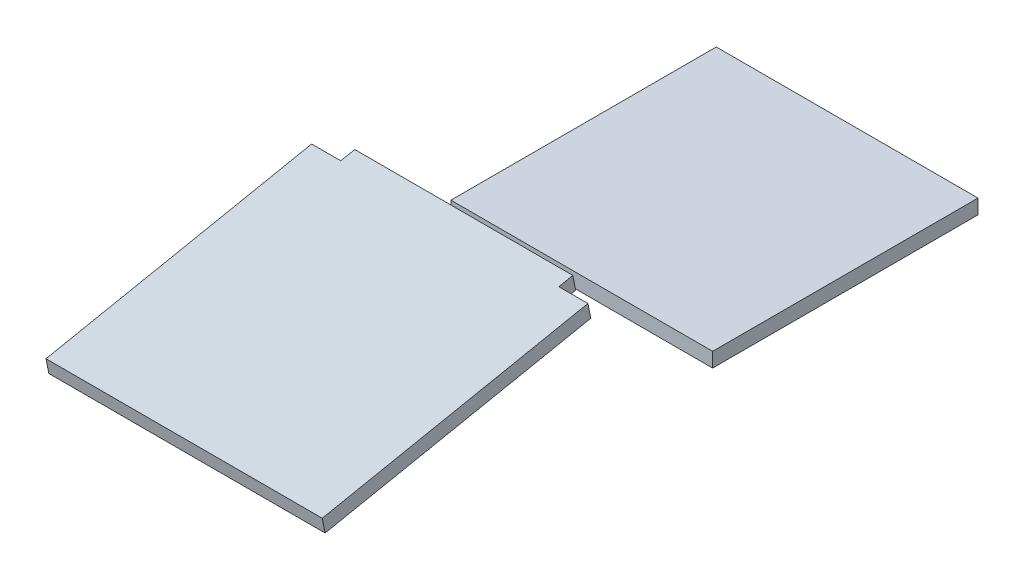
ISO-10303-21;
HEADER;
FILE_DESCRIPTION(('STEP AP214'),'2;1');
FILE_NAME('part.step','',(''),(''),'','','');
FILE_SCHEMA(('AUTOMOTIVE_DESIGN { 1 0 10303 214 1 1 1 1 }'));
ENDSEC;
DATA;
#1=APPLICATION_CONTEXT('core data for automotive mechanical design processes');
#2=APPLICATION_PROTOCOL_DEFINITION('international standard','automotive_design',2000,#1);
#3=PRODUCT_CONTEXT('',#1,'mechanical');
#4=PRODUCT('Part','Part','',(#3));
#5=PRODUCT_RELATED_PRODUCT_CATEGORY('part','',(#4));
#6=PRODUCT_DEFINITION_FORMATION('','',#4);
#7=PRODUCT_DEFINITION_CONTEXT('part definition',#1,'design');
#8=PRODUCT_DEFINITION('design','',#6,#7);
#9=PRODUCT_DEFINITION_SHAPE('','',#8);
#10=(LENGTH_UNIT() NAMED_UNIT(*) SI_UNIT(.MILLI.,.METRE.));
#11=(NAMED_UNIT(*) PLANE_ANGLE_UNIT() SI_UNIT($,.RADIAN.));
#12=(NAMED_UNIT(*) SI_UNIT($,.STERADIAN.) SOLID_ANGLE_UNIT());
#13=UNCERTAINTY_MEASURE_WITH_UNIT(LENGTH_MEASURE(1.E-05),#10,'distance_accuracy_value','');
#14=(GEOMETRIC_REPRESENTATION_CONTEXT(3) GLOBAL_UNCERTAINTY_ASSIGNED_CONTEXT((#13)) GLOBAL_UNIT_ASSIGNED_CONTEXT((#10,
#11,#12)) REPRESENTATION_CONTEXT('',''));
#15=CARTESIAN_POINT('',(0.,0.,0.));
#16=DIRECTION('',(0.,0.,1.));
#17=DIRECTION('',(1.,0.,0.));
#18=AXIS2_PLACEMENT_3D('',#15,#16,#17);
#19=CARTESIAN_POINT('',(-241.3,238.862481606681,457.347496321336));
#20=DIRECTION('',(1.,0.,0.));
#21=DIRECTION('',(0.,0.,-1.));
#22=AXIS2_PLACEMENT_3D('',#19,#20,#21);
#23=PLANE('',#22);
#24=DIRECTION('',(0.,0.196116135138184,-0.98058067569092));
#25=VECTOR('',#24,1.);
#26=CARTESIAN_POINT('',(-241.3,263.769230769231,462.328846153846));
#27=LINE('',#26,#25);
#28=CARTESIAN_POINT('',(-241.3,170.961538461538,926.367307692308));
#29=VERTEX_POINT('',#28);
#30=CARTESIAN_POINT('',(-241.3,263.769230769231,462.328846153846));
#31=VERTEX_POINT('',#30);
#32=EDGE_CURVE('E146',#29,#31,#27,.T.);
#33=ORIENTED_EDGE('',*,*,#32,.T.);
#34=DIRECTION('',(0.,0.98058067569092,0.196116135138184));
#35=VECTOR('',#34,1.);
#36=CARTESIAN_POINT('',(-241.3,238.862481606681,457.347496321336));
#37=LINE('',#36,#35);
#38=CARTESIAN_POINT('',(-241.3,238.862481606681,457.347496321336));
#39=VERTEX_POINT('',#38);
#40=EDGE_CURVE('E58',#39,#31,#37,.T.);
#41=ORIENTED_EDGE('',*,*,#40,.F.);
#42=DIRECTION('',(0.,0.196116135138184,-0.98058067569092));
#43=VECTOR('',#42,1.);
#44=CARTESIAN_POINT('',(-241.3,238.862481606681,457.347496321336));
#45=LINE('',#44,#43);
#46=CARTESIAN_POINT('',(-241.3,146.054789298989,921.385957859798));
#47=VERTEX_POINT('',#46);
#48=EDGE_CURVE('E193',#47,#39,#45,.T.);
#49=ORIENTED_EDGE('',*,*,#48,.F.);
#50=DIRECTION('',(0.,0.98058067569092,0.196116135138184));
#51=VECTOR('',#50,1.);
#52=CARTESIAN_POINT('',(-241.3,146.054789298989,921.385957859798));
#53=LINE('',#52,#51);
#54=EDGE_CURVE('E12',#47,#29,#53,.T.);
#55=ORIENTED_EDGE('',*,*,#54,.T.);
#56=EDGE_LOOP('',(#33,#41,#49,#55));
#57=FACE_BOUND('',#56,.T.);
#58=ADVANCED_FACE('F50',(#57),#23,.F.);
#59=CARTESIAN_POINT('',(-190.5,238.862481606681,457.347496321336));
#60=DIRECTION('',(0.,-0.196116135138184,0.98058067569092));
#61=DIRECTION('',(0.,-0.98058067569092,-0.196116135138184));
#62=AXIS2_PLACEMENT_3D('',#59,#60,#61);
#63=PLANE('',#62);
#64=DIRECTION('',(1.,0.,0.));
#65=VECTOR('',#64,1.);
#66=CARTESIAN_POINT('',(-190.5,263.769230769231,462.328846153846));
#67=LINE('',#66,#65);
#68=CARTESIAN_POINT('',(-190.5,263.769230769231,462.328846153846));
#69=VERTEX_POINT('',#68);
#70=EDGE_CURVE('E148',#31,#69,#67,.T.);
#71=ORIENTED_EDGE('',*,*,#70,.T.);
#72=DIRECTION('',(0.,0.98058067569092,0.196116135138184));
#73=VECTOR('',#72,1.);
#74=CARTESIAN_POINT('',(-190.5,238.862481606681,457.347496321336));
#75=LINE('',#74,#73);
#76=CARTESIAN_POINT('',(-190.5,238.862481606681,457.347496321336));
#77=VERTEX_POINT('',#76);
#78=EDGE_CURVE('E165',#77,#69,#75,.T.);
#79=ORIENTED_EDGE('',*,*,#78,.F.);
#80=DIRECTION('',(1.,0.,0.));
#81=VECTOR('',#80,1.);
#82=CARTESIAN_POINT('',(-190.5,238.862481606681,457.347496321336));
#83=LINE('',#82,#81);
#84=EDGE_CURVE('E174',#39,#77,#83,.T.);
#85=ORIENTED_EDGE('',*,*,#84,.F.);
#86=ORIENTED_EDGE('',*,*,#40,.T.);
#87=EDGE_LOOP('',(#71,#79,#85,#86));
#88=FACE_BOUND('',#87,.T.);
#89=ADVANCED_FACE('F172',(#88),#63,.F.);
#90=CARTESIAN_POINT('',(-190.5,243.747096991297,432.924419398259));
#91=DIRECTION('',(1.,0.,0.));
#92=DIRECTION('',(0.,0.,-1.));
#93=AXIS2_PLACEMENT_3D('',#90,#91,#92);
#94=PLANE('',#93);
#95=DIRECTION('',(0.,0.196116135138184,-0.98058067569092));
#96=VECTOR('',#95,1.);
#97=CARTESIAN_POINT('',(-190.5,268.653846153846,437.905769230769));
#98=LINE('',#97,#96);
#99=CARTESIAN_POINT('',(-190.5,268.653846153846,437.905769230769));
#100=VERTEX_POINT('',#99);
#101=EDGE_CURVE('E150',#69,#100,#98,.T.);
#102=ORIENTED_EDGE('',*,*,#101,.T.);
#103=DIRECTION('',(0.,0.98058067569092,0.196116135138184));
#104=VECTOR('',#103,1.);
#105=CARTESIAN_POINT('',(-190.5,243.747096991297,432.924419398259));
#106=LINE('',#105,#104);
#107=CARTESIAN_POINT('',(-190.5,243.747096991297,432.924419398259));
#108=VERTEX_POINT('',#107);
#109=EDGE_CURVE('E162',#108,#100,#106,.T.);
#110=ORIENTED_EDGE('',*,*,#109,.F.);
#111=DIRECTION('',(0.,0.196116135138184,-0.98058067569092));
#112=VECTOR('',#111,1.);
#113=CARTESIAN_POINT('',(-190.5,243.747096991297,432.924419398259));
#114=LINE('',#113,#112);
#115=EDGE_CURVE('E189',#77,#108,#114,.T.);
#116=ORIENTED_EDGE('',*,*,#115,.F.);
#117=ORIENTED_EDGE('',*,*,#78,.T.);
#118=EDGE_LOOP('',(#102,#110,#116,#117));
#119=FACE_BOUND('',#118,.T.);
#120=ADVANCED_FACE('F185',(#119),#94,.F.);
#121=CARTESIAN_POINT('',(-190.5,243.747096991297,432.924419398259));
#122=DIRECTION('',(0.,-0.196116135138184,0.98058067569092));
#123=DIRECTION('',(0.,-0.98058067569092,-0.196116135138184));
#124=AXIS2_PLACEMENT_3D('',#121,#122,#123);
#125=PLANE('',#124);
#126=DIRECTION('',(1.,0.,0.));
#127=VECTOR('',#126,1.);
#128=CARTESIAN_POINT('',(-190.5,268.653846153846,437.905769230769));
#129=LINE('',#128,#127);
#130=CARTESIAN_POINT('',(190.5,268.653846153846,437.905769230769));
#131=VERTEX_POINT('',#130);
#132=EDGE_CURVE('E152',#100,#131,#129,.T.);
#133=ORIENTED_EDGE('',*,*,#132,.T.);
#134=DIRECTION('',(0.,0.98058067569092,0.196116135138184));
#135=VECTOR('',#134,1.);
#136=CARTESIAN_POINT('',(190.5,243.747096991297,432.924419398259));
#137=LINE('',#136,#135);
#138=CARTESIAN_POINT('',(190.5,243.747096991297,432.924419398259));
#139=VERTEX_POINT('',#138);
#140=EDGE_CURVE('E135',#139,#131,#137,.T.);
#141=ORIENTED_EDGE('',*,*,#140,.F.);
#142=DIRECTION('',(1.,0.,0.));
#143=VECTOR('',#142,1.);
#144=CARTESIAN_POINT('',(-190.5,243.747096991297,432.924419398259));
#145=LINE('',#144,#143);
#146=EDGE_CURVE('E126',#108,#139,#145,.T.);
#147=ORIENTED_EDGE('',*,*,#146,.F.);
#148=ORIENTED_EDGE('',*,*,#109,.T.);
#149=EDGE_LOOP('',(#133,#141,#147,#148));
#150=FACE_BOUND('',#149,.T.);
#151=ADVANCED_FACE('F188',(#150),#125,.F.);
#152=CARTESIAN_POINT('',(190.5,243.747096991297,432.924419398259));
#153=DIRECTION('',(-1.,0.,0.));
#154=DIRECTION('',(0.,0.,1.));
#155=AXIS2_PLACEMENT_3D('',#152,#153,#154);
#156=PLANE('',#155);
#157=DIRECTION('',(0.,-0.196116135138184,0.98058067569092));
#158=VECTOR('',#157,1.);
#159=CARTESIAN_POINT('',(190.5,268.653846153846,437.905769230769));
#160=LINE('',#159,#158);
#161=CARTESIAN_POINT('',(190.5,263.769230769231,462.328846153846));
#162=VERTEX_POINT('',#161);
#163=EDGE_CURVE('E134',#131,#162,#160,.T.);
#164=ORIENTED_EDGE('',*,*,#163,.T.);
#165=DIRECTION('',(0.,0.98058067569092,0.196116135138184));
#166=VECTOR('',#165,1.);
#167=CARTESIAN_POINT('',(190.5,238.862481606681,457.347496321336));
#168=LINE('',#167,#166);
#169=CARTESIAN_POINT('',(190.5,238.862481606681,457.347496321336));
#170=VERTEX_POINT('',#169);
#171=EDGE_CURVE('E131',#170,#162,#168,.T.);
#172=ORIENTED_EDGE('',*,*,#171,.F.);
#173=DIRECTION('',(0.,-0.196116135138184,0.98058067569092));
#174=VECTOR('',#173,1.);
#175=CARTESIAN_POINT('',(190.5,243.747096991297,432.924419398259));
#176=LINE('',#175,#174);
#177=EDGE_CURVE('E120',#139,#170,#176,.T.);
#178=ORIENTED_EDGE('',*,*,#177,.F.);
#179=ORIENTED_EDGE('',*,*,#140,.T.);
#180=EDGE_LOOP('',(#164,#172,#178,#179));
#181=FACE_BOUND('',#180,.T.);
#182=ADVANCED_FACE('F132',(#181),#156,.F.);
#183=CARTESIAN_POINT('',(190.5,238.862481606681,457.347496321336));
#184=DIRECTION('',(0.,-0.196116135138184,0.98058067569092));
#185=DIRECTION('',(0.,-0.98058067569092,-0.196116135138184));
#186=AXIS2_PLACEMENT_3D('',#183,#184,#185);
#187=PLANE('',#186);
#188=DIRECTION('',(1.,0.,0.));
#189=VECTOR('',#188,1.);
#190=CARTESIAN_POINT('',(190.5,263.769230769231,462.328846153846));
#191=LINE('',#190,#189);
#192=CARTESIAN_POINT('',(241.3,263.769230769231,462.328846153846));
#193=VERTEX_POINT('',#192);
#194=EDGE_CURVE('E96',#162,#193,#191,.T.);
#195=ORIENTED_EDGE('',*,*,#194,.T.);
#196=DIRECTION('',(0.,0.98058067569092,0.196116135138184));
#197=VECTOR('',#196,1.);
#198=CARTESIAN_POINT('',(241.3,238.862481606681,457.347496321336));
#199=LINE('',#198,#197);
#200=CARTESIAN_POINT('',(241.3,238.862481606681,457.347496321336));
#201=VERTEX_POINT('',#200);
#202=EDGE_CURVE('E136',#201,#193,#199,.T.);
#203=ORIENTED_EDGE('',*,*,#202,.F.);
#204=DIRECTION('',(1.,0.,0.));
#205=VECTOR('',#204,1.);
#206=CARTESIAN_POINT('',(190.5,238.862481606681,457.347496321336));
#207=LINE('',#206,#205);
#208=EDGE_CURVE('E124',#170,#201,#207,.T.);
#209=ORIENTED_EDGE('',*,*,#208,.F.);
#210=ORIENTED_EDGE('',*,*,#171,.T.);
#211=EDGE_LOOP('',(#195,#203,#209,#210));
#212=FACE_BOUND('',#211,.T.);
#213=ADVANCED_FACE('F138',(#212),#187,.F.);
#214=CARTESIAN_POINT('',(241.3,238.862481606681,457.347496321336));
#215=DIRECTION('',(-1.,0.,0.));
#216=DIRECTION('',(0.,0.,1.));
#217=AXIS2_PLACEMENT_3D('',#214,#215,#216);
#218=PLANE('',#217);
#219=DIRECTION('',(0.,-0.196116135138184,0.98058067569092));
#220=VECTOR('',#219,1.);
#221=CARTESIAN_POINT('',(241.3,263.769230769231,462.328846153846));
#222=LINE('',#221,#220);
#223=CARTESIAN_POINT('',(241.3,170.961538461538,926.367307692308));
#224=VERTEX_POINT('',#223);
#225=EDGE_CURVE('E103',#193,#224,#222,.T.);
#226=ORIENTED_EDGE('',*,*,#225,.T.);
#227=DIRECTION('',(0.,0.98058067569092,0.196116135138184));
#228=VECTOR('',#227,1.);
#229=CARTESIAN_POINT('',(241.3,146.054789298989,921.385957859798));
#230=LINE('',#229,#228);
#231=CARTESIAN_POINT('',(241.3,146.054789298989,921.385957859798));
#232=VERTEX_POINT('',#231);
#233=EDGE_CURVE('E142',#232,#224,#230,.T.);
#234=ORIENTED_EDGE('',*,*,#233,.F.);
#235=DIRECTION('',(0.,-0.196116135138184,0.98058067569092));
#236=VECTOR('',#235,1.);
#237=CARTESIAN_POINT('',(241.3,238.862481606681,457.347496321336));
#238=LINE('',#237,#236);
#239=EDGE_CURVE('E140',#201,#232,#238,.T.);
#240=ORIENTED_EDGE('',*,*,#239,.F.);
#241=ORIENTED_EDGE('',*,*,#202,.T.);
#242=EDGE_LOOP('',(#226,#234,#240,#241));
#243=FACE_BOUND('',#242,.T.);
#244=ADVANCED_FACE('F196',(#243),#218,.F.);
#245=CARTESIAN_POINT('',(190.5,146.054789298989,921.385957859798));
#246=DIRECTION('',(0.,0.196116135138184,-0.98058067569092));
#247=DIRECTION('',(0.,0.98058067569092,0.196116135138184));
#248=AXIS2_PLACEMENT_3D('',#245,#246,#247);
#249=PLANE('',#248);
#250=DIRECTION('',(-1.,0.,0.));
#251=VECTOR('',#250,1.);
#252=CARTESIAN_POINT('',(190.5,170.961538461538,926.367307692308));
#253=LINE('',#252,#251);
#254=EDGE_CURVE('E157',#224,#29,#253,.T.);
#255=ORIENTED_EDGE('',*,*,#254,.T.);
#256=ORIENTED_EDGE('',*,*,#54,.F.);
#257=DIRECTION('',(-1.,0.,0.));
#258=VECTOR('',#257,1.);
#259=CARTESIAN_POINT('',(-190.5,146.054789298989,921.385957859798));
#260=LINE('',#259,#258);
#261=EDGE_CURVE('E66',#232,#47,#260,.T.);
#262=ORIENTED_EDGE('',*,*,#261,.F.);
#263=ORIENTED_EDGE('',*,*,#233,.T.);
#264=EDGE_LOOP('',(#255,#256,#262,#263));
#265=FACE_BOUND('',#264,.T.);
#266=ADVANCED_FACE('F195',(#265),#249,.F.);
#267=CARTESIAN_POINT('',(0.,317.626904683604,63.5253809367209));
#268=DIRECTION('',(0.,-0.98058067569092,-0.196116135138184));
#269=DIRECTION('',(0.,0.196116135138184,-0.98058067569092));
#270=AXIS2_PLACEMENT_3D('',#267,#268,#269);
#271=PLANE('',#270);
#272=ORIENTED_EDGE('',*,*,#261,.T.);
#273=ORIENTED_EDGE('',*,*,#48,.T.);
#274=ORIENTED_EDGE('',*,*,#84,.T.);
#275=ORIENTED_EDGE('',*,*,#115,.T.);
#276=ORIENTED_EDGE('',*,*,#146,.T.);
#277=ORIENTED_EDGE('',*,*,#177,.T.);
#278=ORIENTED_EDGE('',*,*,#208,.T.);
#279=ORIENTED_EDGE('',*,*,#239,.T.);
#280=EDGE_LOOP('',(#272,#273,#274,#275,#276,#277,#278,#279));
#281=FACE_BOUND('',#280,.T.);
#282=ADVANCED_FACE('F122',(#281),#271,.T.);
#283=CARTESIAN_POINT('',(0.,342.533653846154,68.5067307692308));
#284=DIRECTION('',(0.,-0.98058067569092,-0.196116135138184));
#285=DIRECTION('',(0.,0.196116135138184,-0.98058067569092));
#286=AXIS2_PLACEMENT_3D('',#283,#284,#285);
#287=PLANE('',#286);
#288=ORIENTED_EDGE('',*,*,#32,.F.);
#289=ORIENTED_EDGE('',*,*,#254,.F.);
#290=ORIENTED_EDGE('',*,*,#225,.F.);
#291=ORIENTED_EDGE('',*,*,#194,.F.);
#292=ORIENTED_EDGE('',*,*,#163,.F.);
#293=ORIENTED_EDGE('',*,*,#132,.F.);
#294=ORIENTED_EDGE('',*,*,#101,.F.);
#295=ORIENTED_EDGE('',*,*,#70,.F.);
#296=EDGE_LOOP('',(#288,#289,#290,#291,#292,#293,#294,#295));
#297=FACE_BOUND('',#296,.T.);
#298=ADVANCED_FACE('F180',(#297),#287,.F.);
#299=CLOSED_SHELL('',(#58,#89,#120,#151,#182,#213,#244,#266,#282,#298));
#300=MANIFOLD_SOLID_BREP('B2',#299);
#301=CARTESIAN_POINT('',(-228.6,44.45,-231.775));
#302=DIRECTION('',(-1.,0.,0.));
#303=DIRECTION('',(0.,0.,1.));
#304=AXIS2_PLACEMENT_3D('',#301,#302,#303);
#305=PLANE('',#304);
#306=DIRECTION('',(0.,0.,1.));
#307=VECTOR('',#306,1.);
#308=CARTESIAN_POINT('',(-228.6,69.85,-231.775));
#309=LINE('',#308,#307);
#310=CARTESIAN_POINT('',(-228.6,69.85,-231.775));
#311=VERTEX_POINT('',#310);
#312=CARTESIAN_POINT('',(-228.6,69.85,231.775));
#313=VERTEX_POINT('',#312);
#314=EDGE_CURVE('E367',#311,#313,#309,.T.);
#315=ORIENTED_EDGE('',*,*,#314,.F.);
#316=DIRECTION('',(0.,1.,0.));
#317=VECTOR('',#316,1.);
#318=CARTESIAN_POINT('',(-228.6,44.45,-231.775));
#319=LINE('',#318,#317);
#320=CARTESIAN_POINT('',(-228.6,44.45,-231.775));
#321=VERTEX_POINT('',#320);
#322=EDGE_CURVE('E48',#321,#311,#319,.T.);
#323=ORIENTED_EDGE('',*,*,#322,.F.);
#324=DIRECTION('',(0.,0.,1.));
#325=VECTOR('',#324,1.);
#326=CARTESIAN_POINT('',(-228.6,44.45,-231.775));
#327=LINE('',#326,#325);
#328=CARTESIAN_POINT('',(-228.6,44.45,231.775));
#329=VERTEX_POINT('',#328);
#330=EDGE_CURVE('E361',#321,#329,#327,.T.);
#331=ORIENTED_EDGE('',*,*,#330,.T.);
#332=DIRECTION('',(0.,1.,0.));
#333=VECTOR('',#332,1.);
#334=CARTESIAN_POINT('',(-228.6,44.45,231.775));
#335=LINE('',#334,#333);
#336=EDGE_CURVE('E306',#329,#313,#335,.T.);
#337=ORIENTED_EDGE('',*,*,#336,.T.);
#338=EDGE_LOOP('',(#315,#323,#331,#337));
#339=FACE_BOUND('',#338,.T.);
#340=ADVANCED_FACE('F303',(#339),#305,.T.);
#341=CARTESIAN_POINT('',(-228.6,44.45,-231.775));
#342=DIRECTION('',(0.,0.,-1.));
#343=DIRECTION('',(-1.,0.,0.));
#344=AXIS2_PLACEMENT_3D('',#341,#342,#343);
#345=PLANE('',#344);
#346=DIRECTION('',(-1.,0.,0.));
#347=VECTOR('',#346,1.);
#348=CARTESIAN_POINT('',(-228.6,69.85,-231.775));
#349=LINE('',#348,#347);
#350=CARTESIAN_POINT('',(228.6,69.85,-231.775));
#351=VERTEX_POINT('',#350);
#352=EDGE_CURVE('E363',#351,#311,#349,.T.);
#353=ORIENTED_EDGE('',*,*,#352,.F.);
#354=DIRECTION('',(0.,1.,0.));
#355=VECTOR('',#354,1.);
#356=CARTESIAN_POINT('',(228.6,44.45,-231.775));
#357=LINE('',#356,#355);
#358=CARTESIAN_POINT('',(228.6,44.45,-231.775));
#359=VERTEX_POINT('',#358);
#360=EDGE_CURVE('E312',#359,#351,#357,.T.);
#361=ORIENTED_EDGE('',*,*,#360,.F.);
#362=DIRECTION('',(-1.,0.,0.));
#363=VECTOR('',#362,1.);
#364=CARTESIAN_POINT('',(-228.6,44.45,-231.775));
#365=LINE('',#364,#363);
#366=EDGE_CURVE('E358',#359,#321,#365,.T.);
#367=ORIENTED_EDGE('',*,*,#366,.T.);
#368=ORIENTED_EDGE('',*,*,#322,.T.);
#369=EDGE_LOOP('',(#353,#361,#367,#368));
#370=FACE_BOUND('',#369,.T.);
#371=ADVANCED_FACE('F377',(#370),#345,.T.);
#372=CARTESIAN_POINT('',(228.6,44.45,-231.775));
#373=DIRECTION('',(1.,0.,0.));
#374=DIRECTION('',(0.,0.,-1.));
#375=AXIS2_PLACEMENT_3D('',#372,#373,#374);
#376=PLANE('',#375);
#377=DIRECTION('',(0.,0.,-1.));
#378=VECTOR('',#377,1.);
#379=CARTESIAN_POINT('',(228.6,69.85,-231.775));
#380=LINE('',#379,#378);
#381=CARTESIAN_POINT('',(228.6,69.85,231.775));
#382=VERTEX_POINT('',#381);
#383=EDGE_CURVE('E353',#382,#351,#380,.T.);
#384=ORIENTED_EDGE('',*,*,#383,.F.);
#385=DIRECTION('',(0.,1.,0.));
#386=VECTOR('',#385,1.);
#387=CARTESIAN_POINT('',(228.6,44.45,231.775));
#388=LINE('',#387,#386);
#389=CARTESIAN_POINT('',(228.6,44.45,231.775));
#390=VERTEX_POINT('',#389);
#391=EDGE_CURVE('E348',#390,#382,#388,.T.);
#392=ORIENTED_EDGE('',*,*,#391,.F.);
#393=DIRECTION('',(0.,0.,-1.));
#394=VECTOR('',#393,1.);
#395=CARTESIAN_POINT('',(228.6,44.45,-231.775));
#396=LINE('',#395,#394);
#397=EDGE_CURVE('E351',#390,#359,#396,.T.);
#398=ORIENTED_EDGE('',*,*,#397,.T.);
#399=ORIENTED_EDGE('',*,*,#360,.T.);
#400=EDGE_LOOP('',(#384,#392,#398,#399));
#401=FACE_BOUND('',#400,.T.);
#402=ADVANCED_FACE('F350',(#401),#376,.T.);
#403=CARTESIAN_POINT('',(-228.6,44.45,231.775));
#404=DIRECTION('',(0.,0.,1.));
#405=DIRECTION('',(1.,0.,0.));
#406=AXIS2_PLACEMENT_3D('',#403,#404,#405);
#407=PLANE('',#406);
#408=DIRECTION('',(1.,0.,0.));
#409=VECTOR('',#408,1.);
#410=CARTESIAN_POINT('',(-228.6,69.85,231.775));
#411=LINE('',#410,#409);
#412=EDGE_CURVE('E370',#313,#382,#411,.T.);
#413=ORIENTED_EDGE('',*,*,#412,.F.);
#414=ORIENTED_EDGE('',*,*,#336,.F.);
#415=DIRECTION('',(1.,0.,0.));
#416=VECTOR('',#415,1.);
#417=CARTESIAN_POINT('',(-228.6,44.45,231.775));
#418=LINE('',#417,#416);
#419=EDGE_CURVE('E357',#329,#390,#418,.T.);
#420=ORIENTED_EDGE('',*,*,#419,.T.);
#421=ORIENTED_EDGE('',*,*,#391,.T.);
#422=EDGE_LOOP('',(#413,#414,#420,#421));
#423=FACE_BOUND('',#422,.T.);
#424=ADVANCED_FACE('F360',(#423),#407,.T.);
#425=CARTESIAN_POINT('',(0.,44.45,0.));
#426=DIRECTION('',(0.,1.,0.));
#427=DIRECTION('',(0.,0.,1.));
#428=AXIS2_PLACEMENT_3D('',#425,#426,#427);
#429=PLANE('',#428);
#430=ORIENTED_EDGE('',*,*,#330,.F.);
#431=ORIENTED_EDGE('',*,*,#366,.F.);
#432=ORIENTED_EDGE('',*,*,#397,.F.);
#433=ORIENTED_EDGE('',*,*,#419,.F.);
#434=EDGE_LOOP('',(#430,#431,#432,#433));
#435=FACE_BOUND('',#434,.T.);
#436=ADVANCED_FACE('F356',(#435),#429,.F.);
#437=CARTESIAN_POINT('',(0.,69.85,0.));
#438=DIRECTION('',(0.,1.,0.));
#439=DIRECTION('',(0.,0.,1.));
#440=AXIS2_PLACEMENT_3D('',#437,#438,#439);
#441=PLANE('',#440);
#442=ORIENTED_EDGE('',*,*,#314,.T.);
#443=ORIENTED_EDGE('',*,*,#412,.T.);
#444=ORIENTED_EDGE('',*,*,#383,.T.);
#445=ORIENTED_EDGE('',*,*,#352,.T.);
#446=EDGE_LOOP('',(#442,#443,#444,#445));
#447=FACE_BOUND('',#446,.T.);
#448=ADVANCED_FACE('F376',(#447),#441,.T.);
#449=CLOSED_SHELL('',(#340,#371,#402,#424,#436,#448));
#450=MANIFOLD_SOLID_BREP('B6',#449);
#451=ADVANCED_BREP_SHAPE_REPRESENTATION('',(#18,#300,#450),#14);
#452=SHAPE_DEFINITION_REPRESENTATION(#9,#451);
ENDSEC;
END-ISO-10303-21;
